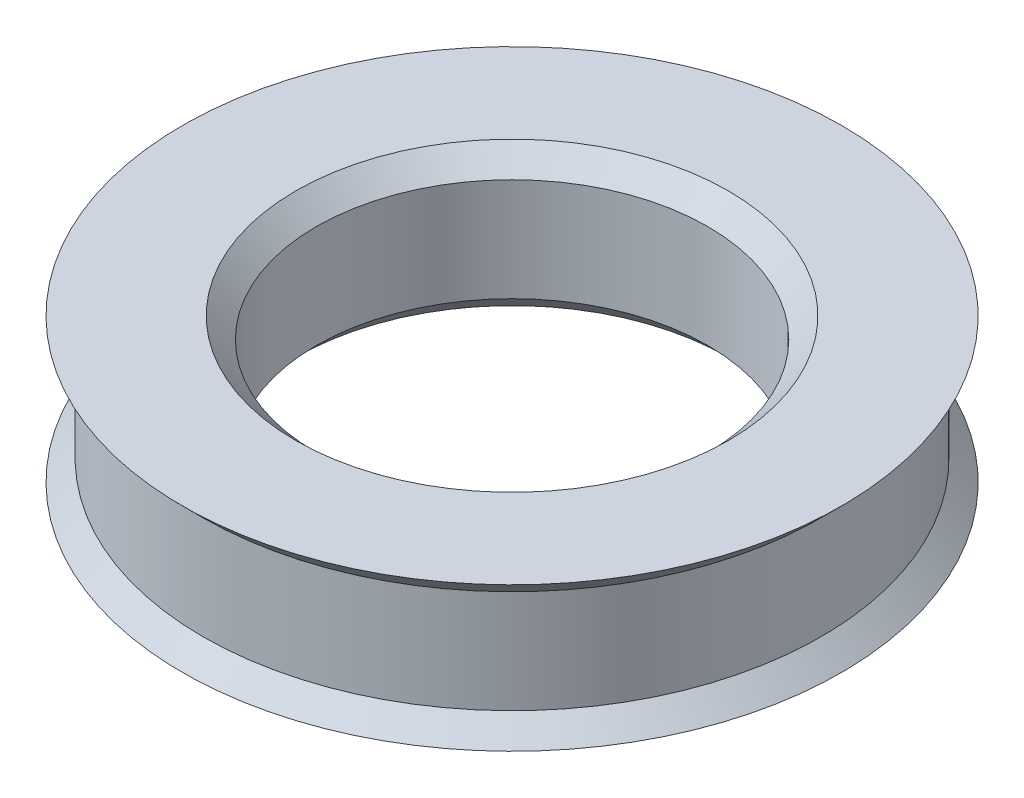
ISO-10303-21;
HEADER;
FILE_DESCRIPTION(('STEP AP214'),'2;1');
FILE_NAME('part.step','',(''),(''),'','','');
FILE_SCHEMA(('AUTOMOTIVE_DESIGN { 1 0 10303 214 1 1 1 1 }'));
ENDSEC;
DATA;
#1=APPLICATION_CONTEXT('core data for automotive mechanical design processes');
#2=APPLICATION_PROTOCOL_DEFINITION('international standard','automotive_design',2000,#1);
#3=PRODUCT_CONTEXT('',#1,'mechanical');
#4=PRODUCT('Part','Part','',(#3));
#5=PRODUCT_RELATED_PRODUCT_CATEGORY('part','',(#4));
#6=PRODUCT_DEFINITION_FORMATION('','',#4);
#7=PRODUCT_DEFINITION_CONTEXT('part definition',#1,'design');
#8=PRODUCT_DEFINITION('design','',#6,#7);
#9=PRODUCT_DEFINITION_SHAPE('','',#8);
#10=(LENGTH_UNIT() NAMED_UNIT(*) SI_UNIT(.MILLI.,.METRE.));
#11=(NAMED_UNIT(*) PLANE_ANGLE_UNIT() SI_UNIT($,.RADIAN.));
#12=(NAMED_UNIT(*) SI_UNIT($,.STERADIAN.) SOLID_ANGLE_UNIT());
#13=UNCERTAINTY_MEASURE_WITH_UNIT(LENGTH_MEASURE(1.E-05),#10,'distance_accuracy_value','');
#14=(GEOMETRIC_REPRESENTATION_CONTEXT(3) GLOBAL_UNCERTAINTY_ASSIGNED_CONTEXT((#13)) GLOBAL_UNIT_ASSIGNED_CONTEXT((#10,
#11,#12)) REPRESENTATION_CONTEXT('',''));
#15=CARTESIAN_POINT('',(0.,0.,0.));
#16=DIRECTION('',(0.,0.,1.));
#17=DIRECTION('',(1.,0.,0.));
#18=AXIS2_PLACEMENT_3D('',#15,#16,#17);
#19=CARTESIAN_POINT('',(16.,3.5,0.));
#20=DIRECTION('',(0.,1.,0.));
#21=DIRECTION('',(0.,0.,1.));
#22=AXIS2_PLACEMENT_3D('',#19,#20,#21);
#23=PLANE('',#22);
#24=CARTESIAN_POINT('',(0.,3.5,0.));
#25=DIRECTION('',(0.,1.,0.));
#26=DIRECTION('',(0.,0.,1.));
#27=AXIS2_PLACEMENT_3D('',#24,#25,#26);
#28=CIRCLE('',#27,10.5);
#29=CARTESIAN_POINT('',(0.,3.5,10.5));
#30=VERTEX_POINT('',#29);
#31=EDGE_CURVE('E46',#30,#30,#28,.F.);
#32=ORIENTED_EDGE('',*,*,#31,.T.);
#33=EDGE_LOOP('',(#32));
#34=FACE_BOUND('',#33,.T.);
#35=CARTESIAN_POINT('',(0.,3.5,0.));
#36=DIRECTION('',(0.,-1.,0.));
#37=DIRECTION('',(0.,0.,-1.));
#38=AXIS2_PLACEMENT_3D('',#35,#36,#37);
#39=CIRCLE('',#38,16.);
#40=CARTESIAN_POINT('',(0.,3.5,-16.));
#41=VERTEX_POINT('',#40);
#42=EDGE_CURVE('E60',#41,#41,#39,.T.);
#43=ORIENTED_EDGE('',*,*,#42,.F.);
#44=EDGE_LOOP('',(#43));
#45=FACE_BOUND('',#44,.T.);
#46=ADVANCED_FACE('F31',(#34,#45),#23,.T.);
#47=CARTESIAN_POINT('',(0.,0.,0.));
#48=DIRECTION('',(0.,-1.,0.));
#49=DIRECTION('',(0.,0.,-1.));
#50=AXIS2_PLACEMENT_3D('',#47,#48,#49);
#51=CYLINDRICAL_SURFACE('',#50,9.5);
#52=CARTESIAN_POINT('',(0.,2.5,0.));
#53=DIRECTION('',(0.,1.,0.));
#54=DIRECTION('',(0.,0.,1.));
#55=AXIS2_PLACEMENT_3D('',#52,#53,#54);
#56=CIRCLE('',#55,9.5);
#57=CARTESIAN_POINT('',(0.,2.5,9.5));
#58=VERTEX_POINT('',#57);
#59=EDGE_CURVE('E38',#58,#58,#56,.T.);
#60=ORIENTED_EDGE('',*,*,#59,.T.);
#61=EDGE_LOOP('',(#60));
#62=FACE_BOUND('',#61,.T.);
#63=CARTESIAN_POINT('',(0.,-2.49999999999999,0.));
#64=DIRECTION('',(0.,-1.,0.));
#65=DIRECTION('',(0.,0.,-1.));
#66=AXIS2_PLACEMENT_3D('',#63,#64,#65);
#67=CIRCLE('',#66,9.5);
#68=CARTESIAN_POINT('',(0.,-2.49999999999999,-9.5));
#69=VERTEX_POINT('',#68);
#70=EDGE_CURVE('E42',#69,#69,#67,.T.);
#71=ORIENTED_EDGE('',*,*,#70,.T.);
#72=EDGE_LOOP('',(#71));
#73=FACE_BOUND('',#72,.T.);
#74=ADVANCED_FACE('F68',(#62,#73),#51,.F.);
#75=CARTESIAN_POINT('',(9.5,-3.5,0.));
#76=DIRECTION('',(0.,-1.,0.));
#77=DIRECTION('',(0.,0.,-1.));
#78=AXIS2_PLACEMENT_3D('',#75,#76,#77);
#79=PLANE('',#78);
#80=CARTESIAN_POINT('',(0.,-3.5,0.));
#81=DIRECTION('',(0.,-1.,0.));
#82=DIRECTION('',(0.,0.,-1.));
#83=AXIS2_PLACEMENT_3D('',#80,#81,#82);
#84=CIRCLE('',#83,10.5);
#85=CARTESIAN_POINT('',(0.,-3.5,-10.5));
#86=VERTEX_POINT('',#85);
#87=EDGE_CURVE('E10',#86,#86,#84,.F.);
#88=ORIENTED_EDGE('',*,*,#87,.T.);
#89=EDGE_LOOP('',(#88));
#90=FACE_BOUND('',#89,.T.);
#91=CARTESIAN_POINT('',(0.,-3.5,0.));
#92=DIRECTION('',(0.,-1.,0.));
#93=DIRECTION('',(0.,0.,-1.));
#94=AXIS2_PLACEMENT_3D('',#91,#92,#93);
#95=CIRCLE('',#94,16.);
#96=CARTESIAN_POINT('',(0.,-3.5,-16.));
#97=VERTEX_POINT('',#96);
#98=EDGE_CURVE('E51',#97,#97,#95,.T.);
#99=ORIENTED_EDGE('',*,*,#98,.T.);
#100=EDGE_LOOP('',(#99));
#101=FACE_BOUND('',#100,.T.);
#102=ADVANCED_FACE('F74',(#90,#101),#79,.T.);
#103=CARTESIAN_POINT('',(0.,-3.5,0.));
#104=DIRECTION('',(0.,-1.,0.));
#105=DIRECTION('',(0.,0.,-1.));
#106=AXIS2_PLACEMENT_3D('',#103,#104,#105);
#107=CONICAL_SURFACE('',#106,16.,0.785398163397449);
#108=CARTESIAN_POINT('',(0.,-2.5,0.));
#109=DIRECTION('',(0.,-1.,0.));
#110=DIRECTION('',(0.,0.,-1.));
#111=AXIS2_PLACEMENT_3D('',#108,#109,#110);
#112=CIRCLE('',#111,15.);
#113=CARTESIAN_POINT('',(0.,-2.5,-15.));
#114=VERTEX_POINT('',#113);
#115=EDGE_CURVE('E54',#114,#114,#112,.T.);
#116=ORIENTED_EDGE('',*,*,#115,.T.);
#117=EDGE_LOOP('',(#116));
#118=FACE_BOUND('',#117,.T.);
#119=ORIENTED_EDGE('',*,*,#98,.F.);
#120=EDGE_LOOP('',(#119));
#121=FACE_BOUND('',#120,.T.);
#122=ADVANCED_FACE('F92',(#118,#121),#107,.T.);
#123=CARTESIAN_POINT('',(0.,0.,0.));
#124=DIRECTION('',(0.,-1.,0.));
#125=DIRECTION('',(0.,0.,-1.));
#126=AXIS2_PLACEMENT_3D('',#123,#124,#125);
#127=CYLINDRICAL_SURFACE('',#126,15.);
#128=CARTESIAN_POINT('',(0.,2.5,0.));
#129=DIRECTION('',(0.,-1.,0.));
#130=DIRECTION('',(0.,0.,-1.));
#131=AXIS2_PLACEMENT_3D('',#128,#129,#130);
#132=CIRCLE('',#131,15.);
#133=CARTESIAN_POINT('',(0.,2.5,-15.));
#134=VERTEX_POINT('',#133);
#135=EDGE_CURVE('E57',#134,#134,#132,.T.);
#136=ORIENTED_EDGE('',*,*,#135,.T.);
#137=EDGE_LOOP('',(#136));
#138=FACE_BOUND('',#137,.T.);
#139=ORIENTED_EDGE('',*,*,#115,.F.);
#140=EDGE_LOOP('',(#139));
#141=FACE_BOUND('',#140,.T.);
#142=ADVANCED_FACE('F85',(#138,#141),#127,.T.);
#143=CARTESIAN_POINT('',(0.,2.5,0.));
#144=DIRECTION('',(0.,1.,0.));
#145=DIRECTION('',(0.,0.,1.));
#146=AXIS2_PLACEMENT_3D('',#143,#144,#145);
#147=CONICAL_SURFACE('',#146,15.,0.785398163397449);
#148=ORIENTED_EDGE('',*,*,#42,.T.);
#149=EDGE_LOOP('',(#148));
#150=FACE_BOUND('',#149,.T.);
#151=ORIENTED_EDGE('',*,*,#135,.F.);
#152=EDGE_LOOP('',(#151));
#153=FACE_BOUND('',#152,.T.);
#154=ADVANCED_FACE('F64',(#150,#153),#147,.T.);
#155=CARTESIAN_POINT('',(0.,3.5,0.));
#156=DIRECTION('',(0.,1.,0.));
#157=DIRECTION('',(0.,0.,1.));
#158=AXIS2_PLACEMENT_3D('',#155,#156,#157);
#159=CONICAL_SURFACE('',#158,10.5,0.785398163397446);
#160=ORIENTED_EDGE('',*,*,#59,.F.);
#161=EDGE_LOOP('',(#160));
#162=FACE_BOUND('',#161,.T.);
#163=ORIENTED_EDGE('',*,*,#31,.F.);
#164=EDGE_LOOP('',(#163));
#165=FACE_BOUND('',#164,.T.);
#166=ADVANCED_FACE('F77',(#162,#165),#159,.F.);
#167=CARTESIAN_POINT('',(0.,-2.49999999999999,0.));
#168=DIRECTION('',(0.,-1.,0.));
#169=DIRECTION('',(0.,0.,-1.));
#170=AXIS2_PLACEMENT_3D('',#167,#168,#169);
#171=CONICAL_SURFACE('',#170,9.5,0.785398163397449);
#172=ORIENTED_EDGE('',*,*,#87,.F.);
#173=EDGE_LOOP('',(#172));
#174=FACE_BOUND('',#173,.T.);
#175=ORIENTED_EDGE('',*,*,#70,.F.);
#176=EDGE_LOOP('',(#175));
#177=FACE_BOUND('',#176,.T.);
#178=ADVANCED_FACE('F33',(#174,#177),#171,.F.);
#179=CLOSED_SHELL('',(#46,#74,#102,#122,#142,#154,#166,#178));
#180=MANIFOLD_SOLID_BREP('B2',#179);
#181=ADVANCED_BREP_SHAPE_REPRESENTATION('',(#18,#180),#14);
#182=SHAPE_DEFINITION_REPRESENTATION(#9,#181);
ENDSEC;
END-ISO-10303-21;
